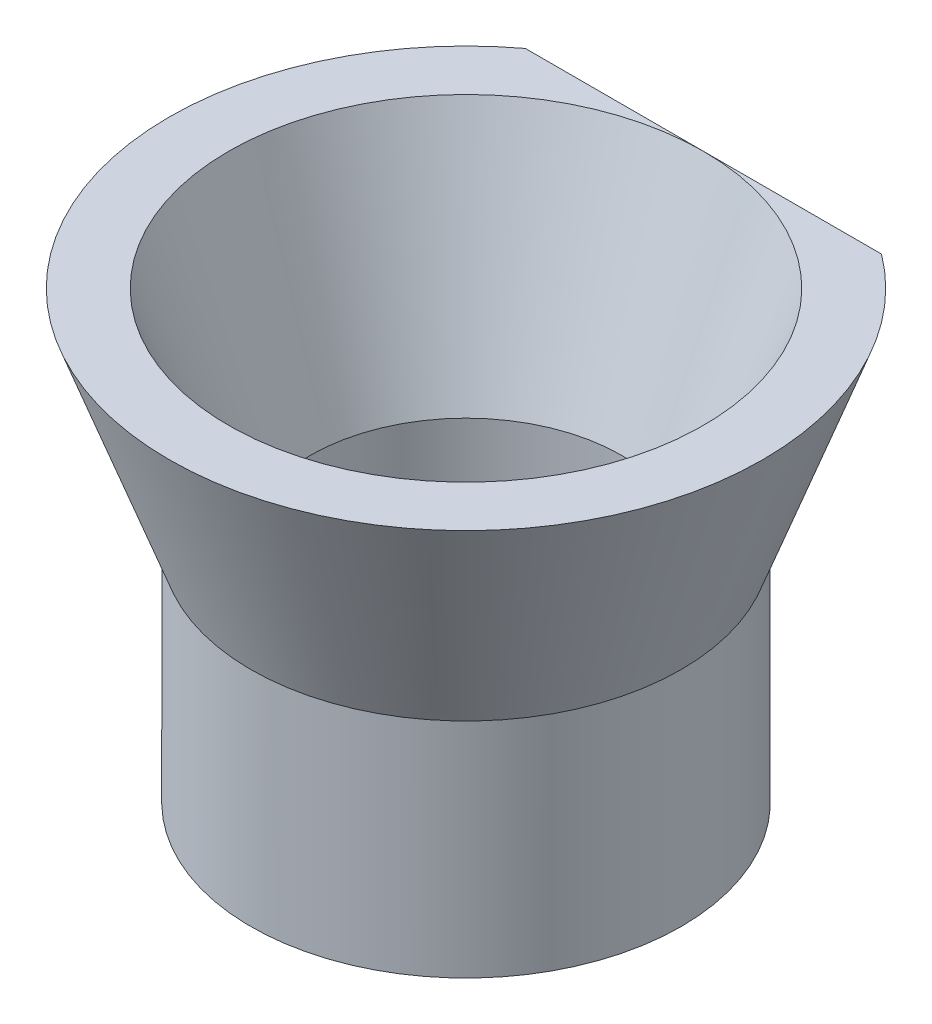
ISO-10303-21;
HEADER;
FILE_DESCRIPTION(('STEP AP214'),'2;1');
FILE_NAME('part.step','',(''),(''),'','','');
FILE_SCHEMA(('AUTOMOTIVE_DESIGN { 1 0 10303 214 1 1 1 1 }'));
ENDSEC;
DATA;
#1=APPLICATION_CONTEXT('core data for automotive mechanical design processes');
#2=APPLICATION_PROTOCOL_DEFINITION('international standard','automotive_design',2000,#1);
#3=PRODUCT_CONTEXT('',#1,'mechanical');
#4=PRODUCT('Part','Part','',(#3));
#5=PRODUCT_RELATED_PRODUCT_CATEGORY('part','',(#4));
#6=PRODUCT_DEFINITION_FORMATION('','',#4);
#7=PRODUCT_DEFINITION_CONTEXT('part definition',#1,'design');
#8=PRODUCT_DEFINITION('design','',#6,#7);
#9=PRODUCT_DEFINITION_SHAPE('','',#8);
#10=(LENGTH_UNIT() NAMED_UNIT(*) SI_UNIT(.MILLI.,.METRE.));
#11=(NAMED_UNIT(*) PLANE_ANGLE_UNIT() SI_UNIT($,.RADIAN.));
#12=(NAMED_UNIT(*) SI_UNIT($,.STERADIAN.) SOLID_ANGLE_UNIT());
#13=UNCERTAINTY_MEASURE_WITH_UNIT(LENGTH_MEASURE(1.E-05),#10,'distance_accuracy_value','');
#14=(GEOMETRIC_REPRESENTATION_CONTEXT(3) GLOBAL_UNCERTAINTY_ASSIGNED_CONTEXT((#13)) GLOBAL_UNIT_ASSIGNED_CONTEXT((#10,
#11,#12)) REPRESENTATION_CONTEXT('',''));
#15=CARTESIAN_POINT('',(0.,0.,0.));
#16=DIRECTION('',(0.,0.,1.));
#17=DIRECTION('',(1.,0.,0.));
#18=AXIS2_PLACEMENT_3D('',#15,#16,#17);
#19=CARTESIAN_POINT('',(0.,0.,0.));
#20=DIRECTION('',(0.,1.,0.));
#21=DIRECTION('',(-1.,0.,0.));
#22=AXIS2_PLACEMENT_3D('',#19,#20,#21);
#23=CONICAL_SURFACE('',#22,5.25,0.351444794003552);
#24=CARTESIAN_POINT('',(0.,7.5,0.));
#25=DIRECTION('',(0.,1.,0.));
#26=DIRECTION('',(-1.,0.,0.));
#27=AXIS2_PLACEMENT_3D('',#24,#25,#26);
#28=CIRCLE('',#27,8.);
#29=CARTESIAN_POINT('',(0.,7.5,-8.));
#30=VERTEX_POINT('',#29);
#31=EDGE_CURVE('E67',#30,#30,#28,.T.);
#32=ORIENTED_EDGE('',*,*,#31,.T.);
#33=EDGE_LOOP('',(#32));
#34=FACE_BOUND('',#33,.T.);
#35=CARTESIAN_POINT('',(0.,0.,0.));
#36=DIRECTION('',(0.,1.,0.));
#37=DIRECTION('',(-1.,0.,0.));
#38=AXIS2_PLACEMENT_3D('',#35,#36,#37);
#39=CIRCLE('',#38,5.25);
#40=CARTESIAN_POINT('',(-5.25,0.,0.));
#41=VERTEX_POINT('',#40);
#42=EDGE_CURVE('E46',#41,#41,#39,.T.);
#43=ORIENTED_EDGE('',*,*,#42,.F.);
#44=EDGE_LOOP('',(#43));
#45=FACE_BOUND('',#44,.T.);
#46=ADVANCED_FACE('F33',(#34,#45),#23,.F.);
#47=CARTESIAN_POINT('',(-8.,7.5,0.));
#48=DIRECTION('',(0.,1.,0.));
#49=DIRECTION('',(-1.,0.,0.));
#50=AXIS2_PLACEMENT_3D('',#47,#48,#49);
#51=PLANE('',#50);
#52=DIRECTION('',(1.,0.,0.));
#53=VECTOR('',#52,1.);
#54=CARTESIAN_POINT('',(-8.60410024606059,7.5,-8.));
#55=LINE('',#54,#53);
#56=CARTESIAN_POINT('',(-6.,7.5,-8.));
#57=VERTEX_POINT('',#56);
#58=EDGE_CURVE('E56',#57,#30,#55,.T.);
#59=ORIENTED_EDGE('',*,*,#58,.F.);
#60=CARTESIAN_POINT('',(0.,7.5,0.));
#61=DIRECTION('',(0.,1.,0.));
#62=DIRECTION('',(-1.,0.,0.));
#63=AXIS2_PLACEMENT_3D('',#60,#61,#62);
#64=CIRCLE('',#63,10.);
#65=CARTESIAN_POINT('',(6.,7.5,-8.));
#66=VERTEX_POINT('',#65);
#67=EDGE_CURVE('E65',#57,#66,#64,.T.);
#68=ORIENTED_EDGE('',*,*,#67,.T.);
#69=EDGE_CURVE('E52',#30,#66,#55,.T.);
#70=ORIENTED_EDGE('',*,*,#69,.F.);
#71=ORIENTED_EDGE('',*,*,#31,.F.);
#72=EDGE_LOOP('',(#59,#68,#70,#71));
#73=FACE_BOUND('',#72,.T.);
#74=ADVANCED_FACE('F64',(#73),#51,.T.);
#75=CARTESIAN_POINT('',(0.,7.5,0.));
#76=DIRECTION('',(0.,1.,0.));
#77=DIRECTION('',(-1.,0.,0.));
#78=AXIS2_PLACEMENT_3D('',#75,#76,#77);
#79=CONICAL_SURFACE('',#78,10.,0.351444794003552);
#80=CARTESIAN_POINT('',(-11.7880127441667,19.0808354845494,-8.));
#81=CARTESIAN_POINT('',(-11.5527327335519,18.549988362712,-8.));
#82=CARTESIAN_POINT('',(-11.3156646800588,18.019924560483,-8.));
#83=CARTESIAN_POINT('',(-10.8370707762402,16.9617427706666,-8.));
#84=CARTESIAN_POINT('',(-10.5955444265098,16.4336250091155,-8.));
#85=CARTESIAN_POINT('',(-10.1060989654761,15.3774478985275,-8.));
#86=CARTESIAN_POINT('',(-9.85815585451044,14.8493996478546,-8.));
#87=CARTESIAN_POINT('',(-9.35574324179913,13.7964497882237,-8.));
#88=CARTESIAN_POINT('',(-9.10127414602016,13.2715479860264,-8.));
#89=CARTESIAN_POINT('',(-8.57047491128102,12.1980347946427,-8.));
#90=CARTESIAN_POINT('',(-8.29370109804602,11.6496422280306,-8.));
#91=CARTESIAN_POINT('',(-7.72843903800512,10.558751904807,-8.));
#92=CARTESIAN_POINT('',(-7.43994862199313,10.0162552635482,-8.));
#93=CARTESIAN_POINT('',(-6.99579835804999,9.20948748982433,-8.));
#94=CARTESIAN_POINT('',(-6.84599966475349,8.94198898701776,-8.));
#95=CARTESIAN_POINT('',(-6.54181857817268,8.40961514136834,-8.));
#96=CARTESIAN_POINT('',(-6.3874363424618,8.14473970876586,-8.));
#97=CARTESIAN_POINT('',(-6.07328984154517,7.61831146011853,-8.));
#98=CARTESIAN_POINT('',(-5.91352736665249,7.35675757792978,-8.));
#99=CARTESIAN_POINT('',(-5.5874893083183,6.83775300517026,-8.));
#100=CARTESIAN_POINT('',(-5.42121438077407,6.58030190504613,-8.));
#101=CARTESIAN_POINT('',(-5.17141132843485,6.20647323560392,-8.));
#102=CARTESIAN_POINT('',(-5.09099547003526,6.08801347712788,-8.));
#103=CARTESIAN_POINT('',(-4.92823467951977,5.85242633924548,-8.));
#104=CARTESIAN_POINT('',(-4.84588973372791,5.73529896929362,-8.));
#105=CARTESIAN_POINT('',(-4.59559917864774,5.38610979910324,-8.));
#106=CARTESIAN_POINT('',(-4.42445058771828,5.15632049720162,-8.));
#107=CARTESIAN_POINT('',(-4.07251955973245,4.70617853359908,-8.));
#108=CARTESIAN_POINT('',(-3.89179430688653,4.48578151134677,-8.));
#109=CARTESIAN_POINT('',(-3.5172478615875,4.05653797149026,-8.));
#110=CARTESIAN_POINT('',(-3.32343526223559,3.84768403547152,-8.));
#111=CARTESIAN_POINT('',(-2.9360844846579,3.46370378585015,-8.));
#112=CARTESIAN_POINT('',(-2.74392192549228,3.28721952086132,-8.));
#113=CARTESIAN_POINT('',(-2.44251567033331,3.0382260316534,-8.));
#114=CARTESIAN_POINT('',(-2.3398077930463,2.95782023500882,-8.));
#115=CARTESIAN_POINT('',(-2.12959291662697,2.80357512330405,-8.));
#116=CARTESIAN_POINT('',(-2.02208667498788,2.72973477725809,-8.));
#117=CARTESIAN_POINT('',(-1.72997635303587,2.54453618984244,-8.));
#118=CARTESIAN_POINT('',(-1.54082118147961,2.4401204195848,-8.));
#119=CARTESIAN_POINT('',(-1.1483061108566,2.26280956447434,-8.));
#120=CARTESIAN_POINT('',(-0.944984503232388,2.18983306759557,-8.));
#121=CARTESIAN_POINT('',(-0.571682474863227,2.09652108968165,-8.));
#122=CARTESIAN_POINT('',(-0.403700989477718,2.06833491993138,-8.));
#123=CARTESIAN_POINT('',(-0.0653714846212546,2.04132260601826,-8.));
#124=CARTESIAN_POINT('',(0.104975421353434,2.04248308621175,-8.));
#125=CARTESIAN_POINT('',(0.442551426452968,2.07396845168604,-8.));
#126=CARTESIAN_POINT('',(0.609785577196916,2.10424093635529,-8.));
#127=CARTESIAN_POINT('',(0.937449710250361,2.19022210227989,-8.));
#128=CARTESIAN_POINT('',(1.0978752751941,2.24594702930793,-8.));
#129=CARTESIAN_POINT('',(1.50374027088981,2.41732295699991,-8.));
#130=CARTESIAN_POINT('',(1.74242462545726,2.54886796932889,-8.));
#131=CARTESIAN_POINT('',(2.08361166749416,2.77130542310563,-8.));
#132=CARTESIAN_POINT('',(2.19477506771437,2.84985201848327,-8.));
#133=CARTESIAN_POINT('',(2.41197891114245,3.01375831684099,-8.));
#134=CARTESIAN_POINT('',(2.51802050734654,3.0991164748511,-8.));
#135=CARTESIAN_POINT('',(2.76885760334046,3.31214755957951,-8.));
#136=CARTESIAN_POINT('',(2.91129447867695,3.4425766184749,-8.));
#137=CARTESIAN_POINT('',(3.18824836054341,3.7116406058069,-8.));
#138=CARTESIAN_POINT('',(3.32276137414141,3.85027960195509,-8.));
#139=CARTESIAN_POINT('',(3.58525493220958,4.13404080343717,-8.));
#140=CARTESIAN_POINT('',(3.71322315804411,4.27917433534412,-8.));
#141=CARTESIAN_POINT('',(3.96340324711761,4.57432726352758,-8.));
#142=CARTESIAN_POINT('',(4.08561437324841,4.72434728130683,-8.));
#143=CARTESIAN_POINT('',(4.32658787121941,5.03014289093962,-8.));
#144=CARTESIAN_POINT('',(4.44528873136023,5.18596677099426,-8.));
#145=CARTESIAN_POINT('',(4.67835046929864,5.50082549855324,-8.));
#146=CARTESIAN_POINT('',(4.79271118329981,5.65986046689722,-8.));
#147=CARTESIAN_POINT('',(5.01752975954726,5.98035774840744,-8.));
#148=CARTESIAN_POINT('',(5.12799239729591,6.1418167197257,-8.));
#149=CARTESIAN_POINT('',(5.34563474479124,6.4669167735361,-8.));
#150=CARTESIAN_POINT('',(5.45281458595604,6.63055776829925,-8.));
#151=CARTESIAN_POINT('',(5.80905190380247,7.18489583882701,-8.));
#152=CARTESIAN_POINT('',(6.05152626170935,7.57982866375914,-8.));
#153=CARTESIAN_POINT('',(6.5244272014536,8.37686811589805,-8.));
#154=CARTESIAN_POINT('',(6.75485150813763,8.77897607874795,-8.));
#155=CARTESIAN_POINT('',(7.20640814995989,9.58866286699196,-8.));
#156=CARTESIAN_POINT('',(7.42753507795253,9.99624469893636,-8.));
#157=CARTESIAN_POINT('',(7.86227615631164,10.8153988953452,-8.));
#158=CARTESIAN_POINT('',(8.07589003836206,11.2269714016618,-8.));
#159=CARTESIAN_POINT('',(8.49765001191727,12.0545045519645,-8.));
#160=CARTESIAN_POINT('',(8.70577716321475,12.4704748269539,-8.));
#161=CARTESIAN_POINT('',(9.11694522806409,13.3049246306868,-8.));
#162=CARTESIAN_POINT('',(9.31998606213487,13.7234041985152,-8.));
#163=CARTESIAN_POINT('',(9.72172961001091,14.5622539741011,-8.));
#164=CARTESIAN_POINT('',(9.92043384619867,14.9826234537998,-8.));
#165=CARTESIAN_POINT('',(10.3142218029195,15.8250548974365,-8.));
#166=CARTESIAN_POINT('',(10.5093055052021,16.2471168698928,-8.));
#167=CARTESIAN_POINT('',(11.0448878503052,17.4170628132649,-8.));
#168=CARTESIAN_POINT('',(11.3821026591513,18.1664501809338,-8.));
#169=CARTESIAN_POINT('',(12.0490566969543,19.6686246711899,-8.));
#170=CARTESIAN_POINT('',(12.3787951599079,20.4214121327494,-8.));
#171=CARTESIAN_POINT('',(13.0303392373198,21.9251050330198,-8.));
#172=CARTESIAN_POINT('',(13.3521803229819,22.6759951172293,-8.));
#173=CARTESIAN_POINT('',(13.8313054401487,23.8038111103441,-8.));
#174=CARTESIAN_POINT('',(13.9903970267358,24.1799709423605,-8.));
#175=CARTESIAN_POINT('',(14.3074820270577,24.9327519234498,-8.));
#176=CARTESIAN_POINT('',(14.4654754440498,25.3093730711505,-8.));
#177=CARTESIAN_POINT('',(14.6229734612365,25.6862013853193,-8.));
#178=B_SPLINE_CURVE_WITH_KNOTS('',3,(#80,#81,#82,#83,#84,#85,#86,#87,#88,#89,#90,#91,#92,#93,
#94,#95,#96,#97,#98,#99,#100,#101,#102,#103,#104,#105,#106,#107,#108,#109,#110,#111,#112,#113,
#114,#115,#116,#117,#118,#119,#120,#121,#122,#123,#124,#125,#126,#127,#128,#129,#130,#131,#132,
#133,#134,#135,#136,#137,#138,#139,#140,#141,#142,#143,#144,#145,#146,#147,#148,#149,#150,#151,
#152,#153,#154,#155,#156,#157,#158,#159,#160,#161,#162,#163,#164,#165,#166,#167,#168,#169,#170,
#171,#172,#173,#174,#175,#176,#177),.UNSPECIFIED.,.F.,.F.,(4,2,2,2,2,2,2,2,2,2,2,2,2,2,2,2,2,2,
2,2,2,2,2,2,2,2,2,2,2,2,2,2,2,2,2,2,2,2,2,2,2,2,2,2,2,2,2,2,4),(0.,1.74196165683616,
3.48411964151781,5.23416827206807,6.98410829889092,8.82684891280719,10.6699322600865,
11.5896557853475,12.5093477287988,13.4287366047348,14.3480331219497,14.777544729909,
15.2070593837459,16.0663748897959,16.9210373163702,17.7751439313013,18.5566868129741,
18.9477832135593,19.338818090631,19.9849029082204,20.6293044827966,21.1379606390931,
21.6463849637894,22.1538958516776,22.6617311270259,23.4743157110766,23.8825288358453,
24.2906496331715,24.8696079034687,25.4488554653554,26.029155936345,26.6095305050744,
27.197097773611,27.784687194837,28.3715298353326,28.9583489523398,30.3482962222512,
31.7385049856184,33.1295113847186,34.5205674109797,35.9159228511817,37.3113000822486,
38.7061793130895,40.1010655733608,42.5662963185201,45.0317785125922,47.4826252906166,
48.7078819631883,49.933134999928),.UNSPECIFIED.);
#179=EDGE_CURVE('E11',#66,#57,#178,.F.);
#180=ORIENTED_EDGE('',*,*,#179,.F.);
#181=ORIENTED_EDGE('',*,*,#67,.F.);
#182=EDGE_LOOP('',(#180,#181));
#183=FACE_BOUND('',#182,.T.);
#184=CARTESIAN_POINT('',(0.,0.,0.));
#185=DIRECTION('',(0.,-1.,0.));
#186=DIRECTION('',(1.,0.,0.));
#187=AXIS2_PLACEMENT_3D('',#184,#185,#186);
#188=CIRCLE('',#187,7.25);
#189=CARTESIAN_POINT('',(7.25,0.,0.));
#190=VERTEX_POINT('',#189);
#191=EDGE_CURVE('E76',#190,#190,#188,.T.);
#192=ORIENTED_EDGE('',*,*,#191,.F.);
#193=EDGE_LOOP('',(#192));
#194=FACE_BOUND('',#193,.T.);
#195=ADVANCED_FACE('F70',(#183,#194),#79,.T.);
#196=CARTESIAN_POINT('',(0.,-7.5,0.));
#197=DIRECTION('',(0.,-1.,0.));
#198=DIRECTION('',(1.,0.,0.));
#199=AXIS2_PLACEMENT_3D('',#196,#197,#198);
#200=PLANE('',#199);
#201=CARTESIAN_POINT('',(0.,-7.5,0.));
#202=DIRECTION('',(0.,-1.,0.));
#203=DIRECTION('',(1.,0.,0.));
#204=AXIS2_PLACEMENT_3D('',#201,#202,#203);
#205=CIRCLE('',#204,7.25);
#206=CARTESIAN_POINT('',(7.25,-7.5,0.));
#207=VERTEX_POINT('',#206);
#208=EDGE_CURVE('E72',#207,#207,#205,.T.);
#209=ORIENTED_EDGE('',*,*,#208,.T.);
#210=EDGE_LOOP('',(#209));
#211=FACE_BOUND('',#210,.T.);
#212=CARTESIAN_POINT('',(0.,-7.5,0.));
#213=DIRECTION('',(0.,-1.,0.));
#214=DIRECTION('',(1.,0.,0.));
#215=AXIS2_PLACEMENT_3D('',#212,#213,#214);
#216=CIRCLE('',#215,5.25);
#217=CARTESIAN_POINT('',(5.25,-7.5,0.));
#218=VERTEX_POINT('',#217);
#219=EDGE_CURVE('E68',#218,#218,#216,.T.);
#220=ORIENTED_EDGE('',*,*,#219,.F.);
#221=EDGE_LOOP('',(#220));
#222=FACE_BOUND('',#221,.T.);
#223=ADVANCED_FACE('F93',(#211,#222),#200,.T.);
#224=CARTESIAN_POINT('',(0.,-7.5,0.));
#225=DIRECTION('',(0.,1.,0.));
#226=DIRECTION('',(-1.,0.,0.));
#227=AXIS2_PLACEMENT_3D('',#224,#225,#226);
#228=CYLINDRICAL_SURFACE('',#227,7.25);
#229=ORIENTED_EDGE('',*,*,#208,.F.);
#230=EDGE_LOOP('',(#229));
#231=FACE_BOUND('',#230,.T.);
#232=ORIENTED_EDGE('',*,*,#191,.T.);
#233=EDGE_LOOP('',(#232));
#234=FACE_BOUND('',#233,.T.);
#235=ADVANCED_FACE('F96',(#231,#234),#228,.T.);
#236=CARTESIAN_POINT('',(0.,-7.5,0.));
#237=DIRECTION('',(0.,1.,0.));
#238=DIRECTION('',(-1.,0.,0.));
#239=AXIS2_PLACEMENT_3D('',#236,#237,#238);
#240=CYLINDRICAL_SURFACE('',#239,5.25);
#241=ORIENTED_EDGE('',*,*,#219,.T.);
#242=EDGE_LOOP('',(#241));
#243=FACE_BOUND('',#242,.T.);
#244=ORIENTED_EDGE('',*,*,#42,.T.);
#245=EDGE_LOOP('',(#244));
#246=FACE_BOUND('',#245,.T.);
#247=ADVANCED_FACE('F82',(#243,#246),#240,.F.);
#248=CARTESIAN_POINT('',(-8.60410024606059,0.,-8.));
#249=DIRECTION('',(0.,0.,1.));
#250=DIRECTION('',(1.,0.,0.));
#251=AXIS2_PLACEMENT_3D('',#248,#249,#250);
#252=PLANE('',#251);
#253=ORIENTED_EDGE('',*,*,#179,.T.);
#254=ORIENTED_EDGE('',*,*,#58,.T.);
#255=ORIENTED_EDGE('',*,*,#69,.T.);
#256=EDGE_LOOP('',(#253,#254,#255));
#257=FACE_BOUND('',#256,.T.);
#258=ADVANCED_FACE('F58',(#257),#252,.F.);
#259=CLOSED_SHELL('',(#46,#74,#195,#223,#235,#247,#258));
#260=MANIFOLD_SOLID_BREP('B2',#259);
#261=ADVANCED_BREP_SHAPE_REPRESENTATION('',(#18,#260),#14);
#262=SHAPE_DEFINITION_REPRESENTATION(#9,#261);
ENDSEC;
END-ISO-10303-21;
